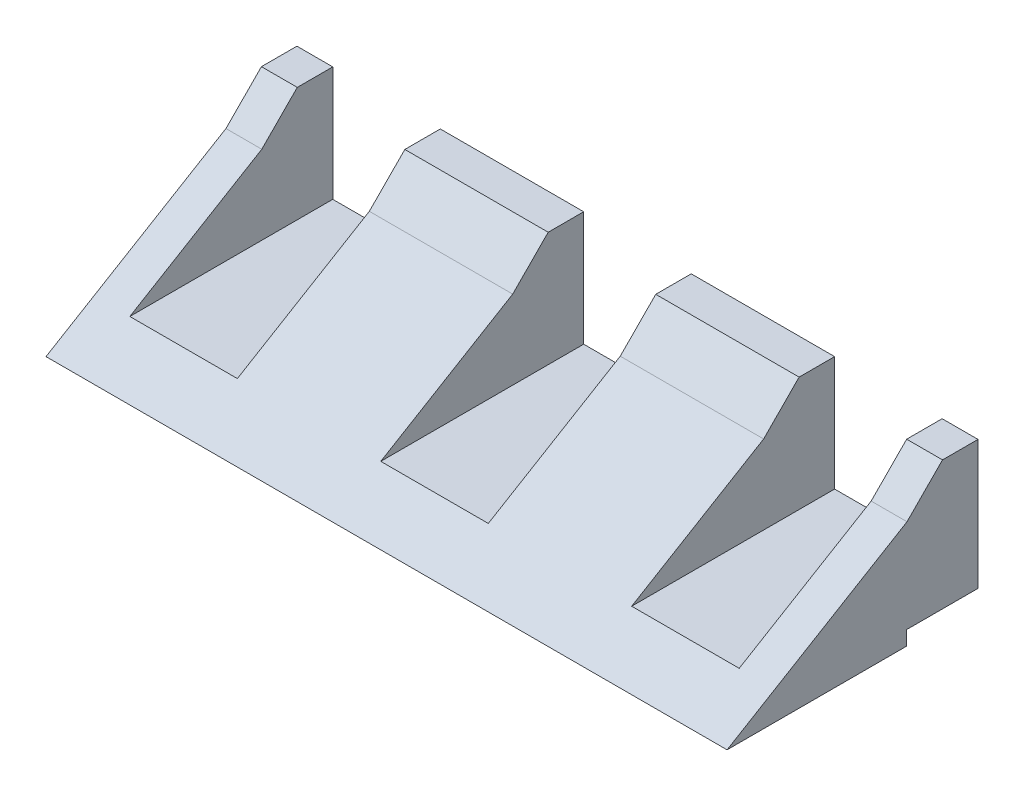
ISO-10303-21;
HEADER;
FILE_DESCRIPTION(('STEP AP214'),'2;1');
FILE_NAME('part.step','',(''),(''),'','','');
FILE_SCHEMA(('AUTOMOTIVE_DESIGN { 1 0 10303 214 1 1 1 1 }'));
ENDSEC;
DATA;
#1=APPLICATION_CONTEXT('core data for automotive mechanical design processes');
#2=APPLICATION_PROTOCOL_DEFINITION('international standard','automotive_design',2000,#1);
#3=PRODUCT_CONTEXT('',#1,'mechanical');
#4=PRODUCT('Part','Part','',(#3));
#5=PRODUCT_RELATED_PRODUCT_CATEGORY('part','',(#4));
#6=PRODUCT_DEFINITION_FORMATION('','',#4);
#7=PRODUCT_DEFINITION_CONTEXT('part definition',#1,'design');
#8=PRODUCT_DEFINITION('design','',#6,#7);
#9=PRODUCT_DEFINITION_SHAPE('','',#8);
#10=(LENGTH_UNIT() NAMED_UNIT(*) SI_UNIT(.MILLI.,.METRE.));
#11=(NAMED_UNIT(*) PLANE_ANGLE_UNIT() SI_UNIT($,.RADIAN.));
#12=(NAMED_UNIT(*) SI_UNIT($,.STERADIAN.) SOLID_ANGLE_UNIT());
#13=UNCERTAINTY_MEASURE_WITH_UNIT(LENGTH_MEASURE(1.E-05),#10,'distance_accuracy_value','');
#14=(GEOMETRIC_REPRESENTATION_CONTEXT(3) GLOBAL_UNCERTAINTY_ASSIGNED_CONTEXT((#13)) GLOBAL_UNIT_ASSIGNED_CONTEXT((#10,
#11,#12)) REPRESENTATION_CONTEXT('',''));
#15=CARTESIAN_POINT('',(0.,0.,0.));
#16=DIRECTION('',(0.,0.,1.));
#17=DIRECTION('',(1.,0.,0.));
#18=AXIS2_PLACEMENT_3D('',#15,#16,#17);
#19=CARTESIAN_POINT('',(0.,0.,0.));
#20=DIRECTION('',(0.,1.,0.));
#21=DIRECTION('',(0.,0.,1.));
#22=AXIS2_PLACEMENT_3D('',#19,#20,#21);
#23=PLANE('',#22);
#24=DIRECTION('',(1.,0.,0.));
#25=VECTOR('',#24,1.);
#26=CARTESIAN_POINT('',(-80.795321637427,0.,-0.877192982456136));
#27=LINE('',#26,#25);
#28=CARTESIAN_POINT('',(-54.7953216374269,0.,-0.877192982456139));
#29=VERTEX_POINT('',#28);
#30=CARTESIAN_POINT('',(40.2046783625731,0.,-0.877192982456146));
#31=VERTEX_POINT('',#30);
#32=EDGE_CURVE('E257',#29,#31,#27,.T.);
#33=ORIENTED_EDGE('',*,*,#32,.T.);
#34=DIRECTION('',(0.,0.,-1.));
#35=VECTOR('',#34,1.);
#36=CARTESIAN_POINT('',(40.2046783625731,0.,24.1228070175439));
#37=LINE('',#36,#35);
#38=CARTESIAN_POINT('',(40.2046783625731,0.,24.1228070175439));
#39=VERTEX_POINT('',#38);
#40=EDGE_CURVE('E215',#39,#31,#37,.T.);
#41=ORIENTED_EDGE('',*,*,#40,.F.);
#42=DIRECTION('',(1.,0.,0.));
#43=VECTOR('',#42,1.);
#44=CARTESIAN_POINT('',(40.2046783625731,0.,24.1228070175439));
#45=LINE('',#44,#43);
#46=CARTESIAN_POINT('',(-54.7953216374269,0.,24.1228070175439));
#47=VERTEX_POINT('',#46);
#48=EDGE_CURVE('E221',#47,#39,#45,.T.);
#49=ORIENTED_EDGE('',*,*,#48,.F.);
#50=DIRECTION('',(0.,0.,1.));
#51=VECTOR('',#50,1.);
#52=CARTESIAN_POINT('',(-54.7953216374269,0.,24.1228070175439));
#53=LINE('',#52,#51);
#54=EDGE_CURVE('E209',#29,#47,#53,.T.);
#55=ORIENTED_EDGE('',*,*,#54,.F.);
#56=EDGE_LOOP('',(#33,#41,#49,#55));
#57=FACE_BOUND('',#56,.T.);
#58=ADVANCED_FACE('F32',(#57),#23,.F.);
#59=CARTESIAN_POINT('',(0.,20.,0.));
#60=DIRECTION('',(0.,1.,0.));
#61=DIRECTION('',(0.,0.,1.));
#62=AXIS2_PLACEMENT_3D('',#59,#60,#61);
#63=PLANE('',#62);
#64=DIRECTION('',(-1.,0.,0.));
#65=VECTOR('',#64,1.);
#66=CARTESIAN_POINT('',(41.2046783625731,20.,-5.92683447989541));
#67=LINE('',#66,#65);
#68=CARTESIAN_POINT('',(-49.7953216374269,20.,-5.92683447989541));
#69=VERTEX_POINT('',#68);
#70=CARTESIAN_POINT('',(-54.7953216374269,20.,-5.92683447989541));
#71=VERTEX_POINT('',#70);
#72=EDGE_CURVE('E179',#69,#71,#67,.T.);
#73=ORIENTED_EDGE('',*,*,#72,.F.);
#74=DIRECTION('',(0.,0.,-1.));
#75=VECTOR('',#74,1.);
#76=CARTESIAN_POINT('',(-49.7953216374269,20.,33.));
#77=LINE('',#76,#75);
#78=CARTESIAN_POINT('',(-49.7953216374269,20.,-10.8771929824562));
#79=VERTEX_POINT('',#78);
#80=EDGE_CURVE('E305',#69,#79,#77,.T.);
#81=ORIENTED_EDGE('',*,*,#80,.T.);
#82=DIRECTION('',(1.,0.,0.));
#83=VECTOR('',#82,1.);
#84=CARTESIAN_POINT('',(-54.7963216374269,20.,-10.8771929824561));
#85=LINE('',#84,#83);
#86=CARTESIAN_POINT('',(-54.7953216374269,20.,-10.8771929824561));
#87=VERTEX_POINT('',#86);
#88=EDGE_CURVE('E203',#87,#79,#85,.T.);
#89=ORIENTED_EDGE('',*,*,#88,.F.);
#90=DIRECTION('',(0.,0.,-1.));
#91=VECTOR('',#90,1.);
#92=CARTESIAN_POINT('',(-54.7953216374269,20.,-11.));
#93=LINE('',#92,#91);
#94=EDGE_CURVE('E194',#71,#87,#93,.T.);
#95=ORIENTED_EDGE('',*,*,#94,.F.);
#96=EDGE_LOOP('',(#73,#81,#89,#95));
#97=FACE_BOUND('',#96,.T.);
#98=ADVANCED_FACE('F201',(#97),#63,.T.);
#99=CARTESIAN_POINT('',(-14.7953216374269,20.,-5.92683447989541));
#100=VERTEX_POINT('',#99);
#101=CARTESIAN_POINT('',(-34.7953216374269,20.,-5.92683447989541));
#102=VERTEX_POINT('',#101);
#103=EDGE_CURVE('E189',#100,#102,#67,.T.);
#104=ORIENTED_EDGE('',*,*,#103,.F.);
#105=DIRECTION('',(0.,0.,-1.));
#106=VECTOR('',#105,1.);
#107=CARTESIAN_POINT('',(-14.7953216374269,20.,33.));
#108=LINE('',#107,#106);
#109=CARTESIAN_POINT('',(-14.7953216374269,20.,-10.8771929824562));
#110=VERTEX_POINT('',#109);
#111=EDGE_CURVE('E295',#100,#110,#108,.T.);
#112=ORIENTED_EDGE('',*,*,#111,.T.);
#113=CARTESIAN_POINT('',(-34.7953216374269,20.,-10.8771929824562));
#114=VERTEX_POINT('',#113);
#115=EDGE_CURVE('E406',#114,#110,#85,.T.);
#116=ORIENTED_EDGE('',*,*,#115,.F.);
#117=DIRECTION('',(0.,0.,-1.));
#118=VECTOR('',#117,1.);
#119=CARTESIAN_POINT('',(-34.7953216374269,20.,33.));
#120=LINE('',#119,#118);
#121=EDGE_CURVE('E292',#102,#114,#120,.T.);
#122=ORIENTED_EDGE('',*,*,#121,.F.);
#123=EDGE_LOOP('',(#104,#112,#116,#122));
#124=FACE_BOUND('',#123,.T.);
#125=ADVANCED_FACE('F405',(#124),#63,.T.);
#126=CARTESIAN_POINT('',(20.2046783625731,20.,-5.92683447989541));
#127=VERTEX_POINT('',#126);
#128=CARTESIAN_POINT('',(0.204678362573135,20.,-5.92683447989541));
#129=VERTEX_POINT('',#128);
#130=EDGE_CURVE('E54',#127,#129,#67,.T.);
#131=ORIENTED_EDGE('',*,*,#130,.F.);
#132=DIRECTION('',(0.,0.,-1.));
#133=VECTOR('',#132,1.);
#134=CARTESIAN_POINT('',(20.2046783625731,20.,33.));
#135=LINE('',#134,#133);
#136=CARTESIAN_POINT('',(20.2046783625731,20.,-10.8771929824562));
#137=VERTEX_POINT('',#136);
#138=EDGE_CURVE('E313',#127,#137,#135,.T.);
#139=ORIENTED_EDGE('',*,*,#138,.T.);
#140=CARTESIAN_POINT('',(0.204678362573135,20.,-10.8771929824562));
#141=VERTEX_POINT('',#140);
#142=EDGE_CURVE('E273',#141,#137,#85,.T.);
#143=ORIENTED_EDGE('',*,*,#142,.F.);
#144=DIRECTION('',(0.,0.,-1.));
#145=VECTOR('',#144,1.);
#146=CARTESIAN_POINT('',(0.204678362573135,20.,33.));
#147=LINE('',#146,#145);
#148=EDGE_CURVE('E297',#129,#141,#147,.T.);
#149=ORIENTED_EDGE('',*,*,#148,.F.);
#150=EDGE_LOOP('',(#131,#139,#143,#149));
#151=FACE_BOUND('',#150,.T.);
#152=ADVANCED_FACE('F412',(#151),#63,.T.);
#153=CARTESIAN_POINT('',(40.2046783625731,20.,-5.92683447989541));
#154=VERTEX_POINT('',#153);
#155=CARTESIAN_POINT('',(35.2046783625731,20.,-5.92683447989541));
#156=VERTEX_POINT('',#155);
#157=EDGE_CURVE('E47',#154,#156,#67,.T.);
#158=ORIENTED_EDGE('',*,*,#157,.F.);
#159=DIRECTION('',(0.,0.,-1.));
#160=VECTOR('',#159,1.);
#161=CARTESIAN_POINT('',(40.2046783625731,20.,24.1228070175439));
#162=LINE('',#161,#160);
#163=CARTESIAN_POINT('',(40.2046783625731,20.,-10.8771929824562));
#164=VERTEX_POINT('',#163);
#165=EDGE_CURVE('E218',#154,#164,#162,.T.);
#166=ORIENTED_EDGE('',*,*,#165,.T.);
#167=CARTESIAN_POINT('',(35.2046783625731,20.,-10.8771929824562));
#168=VERTEX_POINT('',#167);
#169=EDGE_CURVE('E271',#168,#164,#85,.T.);
#170=ORIENTED_EDGE('',*,*,#169,.F.);
#171=DIRECTION('',(0.,0.,-1.));
#172=VECTOR('',#171,1.);
#173=CARTESIAN_POINT('',(35.2046783625731,20.,33.));
#174=LINE('',#173,#172);
#175=EDGE_CURVE('E315',#156,#168,#174,.T.);
#176=ORIENTED_EDGE('',*,*,#175,.F.);
#177=EDGE_LOOP('',(#158,#166,#170,#176));
#178=FACE_BOUND('',#177,.T.);
#179=ADVANCED_FACE('F397',(#178),#63,.T.);
#180=CARTESIAN_POINT('',(-59.7963216374269,15.,-0.976475977334668));
#181=DIRECTION('',(0.,-0.858390415060727,-0.512996973998748));
#182=DIRECTION('',(0.,0.512996973998748,-0.858390415060728));
#183=AXIS2_PLACEMENT_3D('',#180,#181,#182);
#184=PLANE('',#183);
#185=DIRECTION('',(0.,-0.512996973998748,0.858390415060728));
#186=VECTOR('',#185,1.);
#187=CARTESIAN_POINT('',(-14.7953216374269,15.,-0.976475977334667));
#188=LINE('',#187,#186);
#189=CARTESIAN_POINT('',(-14.7953216374269,15.,-0.976475977334676));
#190=VERTEX_POINT('',#189);
#191=CARTESIAN_POINT('',(-14.7953216374269,3.99999999999999,17.4296648855763));
#192=VERTEX_POINT('',#191);
#193=EDGE_CURVE('E246',#190,#192,#188,.T.);
#194=ORIENTED_EDGE('',*,*,#193,.F.);
#195=DIRECTION('',(1.,0.,0.));
#196=VECTOR('',#195,1.);
#197=CARTESIAN_POINT('',(-59.7963216374269,15.,-0.976475977334668));
#198=LINE('',#197,#196);
#199=CARTESIAN_POINT('',(-34.7953216374269,15.,-0.976475977334668));
#200=VERTEX_POINT('',#199);
#201=EDGE_CURVE('E216',#200,#190,#198,.T.);
#202=ORIENTED_EDGE('',*,*,#201,.F.);
#203=DIRECTION('',(0.,0.512996973998748,-0.858390415060728));
#204=VECTOR('',#203,1.);
#205=CARTESIAN_POINT('',(-34.7953216374269,15.,-0.976475977334669));
#206=LINE('',#205,#204);
#207=CARTESIAN_POINT('',(-34.7953216374269,4.,17.4296648855763));
#208=VERTEX_POINT('',#207);
#209=EDGE_CURVE('E237',#208,#200,#206,.T.);
#210=ORIENTED_EDGE('',*,*,#209,.F.);
#211=DIRECTION('',(1.,0.,0.));
#212=VECTOR('',#211,1.);
#213=CARTESIAN_POINT('',(-59.7963216374269,3.99999999999999,17.4296648855763));
#214=LINE('',#213,#212);
#215=CARTESIAN_POINT('',(-49.7953216374269,3.99999999999999,17.4296648855763));
#216=VERTEX_POINT('',#215);
#217=EDGE_CURVE('E232',#216,#208,#214,.T.);
#218=ORIENTED_EDGE('',*,*,#217,.F.);
#219=DIRECTION('',(0.,-0.512996973998748,0.858390415060728));
#220=VECTOR('',#219,1.);
#221=CARTESIAN_POINT('',(-49.7953216374269,15.,-0.976475977334669));
#222=LINE('',#221,#220);
#223=CARTESIAN_POINT('',(-49.7953216374269,15.,-0.976475977334676));
#224=VERTEX_POINT('',#223);
#225=EDGE_CURVE('E234',#224,#216,#222,.T.);
#226=ORIENTED_EDGE('',*,*,#225,.F.);
#227=CARTESIAN_POINT('',(-54.7953216374269,15.,-0.976475977334668));
#228=VERTEX_POINT('',#227);
#229=EDGE_CURVE('E213',#228,#224,#198,.T.);
#230=ORIENTED_EDGE('',*,*,#229,.F.);
#231=DIRECTION('',(0.,0.512996973998748,-0.858390415060727));
#232=VECTOR('',#231,1.);
#233=CARTESIAN_POINT('',(-54.7953216374269,15.,-0.976475977334668));
#234=LINE('',#233,#232);
#235=EDGE_CURVE('E197',#47,#228,#234,.T.);
#236=ORIENTED_EDGE('',*,*,#235,.F.);
#237=ORIENTED_EDGE('',*,*,#48,.T.);
#238=DIRECTION('',(0.,0.512996973998748,-0.858390415060728));
#239=VECTOR('',#238,1.);
#240=CARTESIAN_POINT('',(40.2046783625731,15.,-0.976475977334676));
#241=LINE('',#240,#239);
#242=CARTESIAN_POINT('',(40.2046783625731,15.,-0.976475977334668));
#243=VERTEX_POINT('',#242);
#244=EDGE_CURVE('E204',#39,#243,#241,.T.);
#245=ORIENTED_EDGE('',*,*,#244,.T.);
#246=CARTESIAN_POINT('',(35.2046783625731,15.,-0.976475977334668));
#247=VERTEX_POINT('',#246);
#248=EDGE_CURVE('E207',#247,#243,#198,.T.);
#249=ORIENTED_EDGE('',*,*,#248,.F.);
#250=DIRECTION('',(0.,0.512996973998748,-0.858390415060728));
#251=VECTOR('',#250,1.);
#252=CARTESIAN_POINT('',(35.2046783625731,15.,-0.97647597733467));
#253=LINE('',#252,#251);
#254=CARTESIAN_POINT('',(35.2046783625731,4.,17.4296648855762));
#255=VERTEX_POINT('',#254);
#256=EDGE_CURVE('E229',#255,#247,#253,.T.);
#257=ORIENTED_EDGE('',*,*,#256,.F.);
#258=DIRECTION('',(1.,0.,0.));
#259=VECTOR('',#258,1.);
#260=CARTESIAN_POINT('',(-59.7963216374269,3.99999999999998,17.4296648855763));
#261=LINE('',#260,#259);
#262=CARTESIAN_POINT('',(20.2046783625731,4.,17.4296648855762));
#263=VERTEX_POINT('',#262);
#264=EDGE_CURVE('E220',#263,#255,#261,.T.);
#265=ORIENTED_EDGE('',*,*,#264,.F.);
#266=DIRECTION('',(0.,-0.512996973998748,0.858390415060728));
#267=VECTOR('',#266,1.);
#268=CARTESIAN_POINT('',(20.2046783625731,15.,-0.97647597733467));
#269=LINE('',#268,#267);
#270=CARTESIAN_POINT('',(20.2046783625731,15.,-0.976475977334668));
#271=VERTEX_POINT('',#270);
#272=EDGE_CURVE('E226',#271,#263,#269,.T.);
#273=ORIENTED_EDGE('',*,*,#272,.F.);
#274=CARTESIAN_POINT('',(0.204678362573138,15.,-0.976475977334668));
#275=VERTEX_POINT('',#274);
#276=EDGE_CURVE('E217',#275,#271,#198,.T.);
#277=ORIENTED_EDGE('',*,*,#276,.F.);
#278=DIRECTION('',(0.,0.512996973998748,-0.858390415060728));
#279=VECTOR('',#278,1.);
#280=CARTESIAN_POINT('',(0.204678362573138,15.,-0.976475977334673));
#281=LINE('',#280,#279);
#282=CARTESIAN_POINT('',(0.204678362573139,4.,17.4296648855763));
#283=VERTEX_POINT('',#282);
#284=EDGE_CURVE('E240',#283,#275,#281,.T.);
#285=ORIENTED_EDGE('',*,*,#284,.F.);
#286=DIRECTION('',(1.,0.,0.));
#287=VECTOR('',#286,1.);
#288=CARTESIAN_POINT('',(-59.7963216374269,3.99999999999999,17.4296648855763));
#289=LINE('',#288,#287);
#290=EDGE_CURVE('E243',#192,#283,#289,.T.);
#291=ORIENTED_EDGE('',*,*,#290,.F.);
#292=EDGE_LOOP('',(#194,#202,#210,#218,#226,#230,#236,#237,#245,#249,#257,#265,#273,#277,#285,#291));
#293=FACE_BOUND('',#292,.T.);
#294=ADVANCED_FACE('F320',(#293),#184,.F.);
#295=CARTESIAN_POINT('',(40.2046783625731,20.,24.1228070175439));
#296=DIRECTION('',(-1.,0.,0.));
#297=DIRECTION('',(0.,0.,1.));
#298=AXIS2_PLACEMENT_3D('',#295,#296,#297);
#299=PLANE('',#298);
#300=ORIENTED_EDGE('',*,*,#165,.F.);
#301=DIRECTION('',(0.,-0.710625633720002,0.703570329604685));
#302=VECTOR('',#301,1.);
#303=CARTESIAN_POINT('',(40.2046783625731,4.97592714653301,8.94807487875505));
#304=LINE('',#303,#302);
#305=EDGE_CURVE('E329',#154,#243,#304,.T.);
#306=ORIENTED_EDGE('',*,*,#305,.T.);
#307=ORIENTED_EDGE('',*,*,#244,.F.);
#308=ORIENTED_EDGE('',*,*,#40,.T.);
#309=DIRECTION('',(0.,1.,0.));
#310=VECTOR('',#309,1.);
#311=CARTESIAN_POINT('',(40.2046783625731,0.,-0.877192982456146));
#312=LINE('',#311,#310);
#313=CARTESIAN_POINT('',(40.2046783625731,2.,-0.877192982456139));
#314=VERTEX_POINT('',#313);
#315=EDGE_CURVE('E327',#31,#314,#312,.T.);
#316=ORIENTED_EDGE('',*,*,#315,.T.);
#317=DIRECTION('',(0.,0.,1.));
#318=VECTOR('',#317,1.);
#319=CARTESIAN_POINT('',(40.2046783625731,2.,0.));
#320=LINE('',#319,#318);
#321=CARTESIAN_POINT('',(40.2046783625731,2.,-10.8771929824562));
#322=VERTEX_POINT('',#321);
#323=EDGE_CURVE('E392',#322,#314,#320,.T.);
#324=ORIENTED_EDGE('',*,*,#323,.F.);
#325=DIRECTION('',(0.,-1.,0.));
#326=VECTOR('',#325,1.);
#327=CARTESIAN_POINT('',(40.2046783625731,0.,-10.8771929824562));
#328=LINE('',#327,#326);
#329=EDGE_CURVE('E270',#164,#322,#328,.T.);
#330=ORIENTED_EDGE('',*,*,#329,.F.);
#331=EDGE_LOOP('',(#300,#306,#307,#308,#316,#324,#330));
#332=FACE_BOUND('',#331,.T.);
#333=ADVANCED_FACE('F34',(#332),#299,.F.);
#334=CARTESIAN_POINT('',(-54.7953216374269,0.,0.));
#335=DIRECTION('',(1.,0.,0.));
#336=DIRECTION('',(0.,0.,-1.));
#337=AXIS2_PLACEMENT_3D('',#334,#335,#336);
#338=PLANE('',#337);
#339=ORIENTED_EDGE('',*,*,#235,.T.);
#340=DIRECTION('',(0.,-0.710625633720002,0.703570329604685));
#341=VECTOR('',#340,1.);
#342=CARTESIAN_POINT('',(-54.7953216374269,15.,-0.976475977334668));
#343=LINE('',#342,#341);
#344=EDGE_CURVE('E182',#71,#228,#343,.T.);
#345=ORIENTED_EDGE('',*,*,#344,.F.);
#346=ORIENTED_EDGE('',*,*,#94,.T.);
#347=DIRECTION('',(0.,1.,0.));
#348=VECTOR('',#347,1.);
#349=CARTESIAN_POINT('',(-54.7953216374269,0.,-10.8771929824561));
#350=LINE('',#349,#348);
#351=CARTESIAN_POINT('',(-54.7953216374269,2.,-10.8771929824561));
#352=VERTEX_POINT('',#351);
#353=EDGE_CURVE('E259',#352,#87,#350,.T.);
#354=ORIENTED_EDGE('',*,*,#353,.F.);
#355=DIRECTION('',(0.,0.,1.));
#356=VECTOR('',#355,1.);
#357=CARTESIAN_POINT('',(-54.7953216374269,2.,0.));
#358=LINE('',#357,#356);
#359=CARTESIAN_POINT('',(-54.7953216374269,2.,-0.87719298245613));
#360=VERTEX_POINT('',#359);
#361=EDGE_CURVE('E248',#352,#360,#358,.T.);
#362=ORIENTED_EDGE('',*,*,#361,.T.);
#363=DIRECTION('',(0.,1.,0.));
#364=VECTOR('',#363,1.);
#365=CARTESIAN_POINT('',(-54.7953216374269,0.,-0.877192982456139));
#366=LINE('',#365,#364);
#367=EDGE_CURVE('E40',#29,#360,#366,.T.);
#368=ORIENTED_EDGE('',*,*,#367,.F.);
#369=ORIENTED_EDGE('',*,*,#54,.T.);
#370=EDGE_LOOP('',(#339,#345,#346,#354,#362,#368,#369));
#371=FACE_BOUND('',#370,.T.);
#372=ADVANCED_FACE('F192',(#371),#338,.F.);
#373=CARTESIAN_POINT('',(35.2046783625731,4.,33.));
#374=DIRECTION('',(-1.,0.,0.));
#375=DIRECTION('',(0.,0.,1.));
#376=AXIS2_PLACEMENT_3D('',#373,#374,#375);
#377=PLANE('',#376);
#378=DIRECTION('',(0.,-0.710625633720002,0.703570329604685));
#379=VECTOR('',#378,1.);
#380=CARTESIAN_POINT('',(35.2046783625731,-7.54226906407349,21.341986688335));
#381=LINE('',#380,#379);
#382=EDGE_CURVE('E385',#156,#247,#381,.T.);
#383=ORIENTED_EDGE('',*,*,#382,.F.);
#384=ORIENTED_EDGE('',*,*,#175,.T.);
#385=DIRECTION('',(0.,-1.,0.));
#386=VECTOR('',#385,1.);
#387=CARTESIAN_POINT('',(35.2046783625731,0.,-10.8771929824562));
#388=LINE('',#387,#386);
#389=CARTESIAN_POINT('',(35.2046783625731,4.,-10.8771929824562));
#390=VERTEX_POINT('',#389);
#391=EDGE_CURVE('E275',#168,#390,#388,.T.);
#392=ORIENTED_EDGE('',*,*,#391,.T.);
#393=DIRECTION('',(0.,0.,-1.));
#394=VECTOR('',#393,1.);
#395=CARTESIAN_POINT('',(35.2046783625731,4.,33.));
#396=LINE('',#395,#394);
#397=EDGE_CURVE('E299',#255,#390,#396,.T.);
#398=ORIENTED_EDGE('',*,*,#397,.F.);
#399=ORIENTED_EDGE('',*,*,#256,.T.);
#400=EDGE_LOOP('',(#383,#384,#392,#398,#399));
#401=FACE_BOUND('',#400,.T.);
#402=ADVANCED_FACE('F374',(#401),#377,.T.);
#403=CARTESIAN_POINT('',(20.2046783625731,20.,33.));
#404=DIRECTION('',(1.,0.,0.));
#405=DIRECTION('',(0.,0.,-1.));
#406=AXIS2_PLACEMENT_3D('',#403,#404,#405);
#407=PLANE('',#406);
#408=DIRECTION('',(0.,0.710625633720002,-0.703570329604685));
#409=VECTOR('',#408,1.);
#410=CARTESIAN_POINT('',(20.2046783625731,0.537551596725781,13.3423849068642));
#411=LINE('',#410,#409);
#412=EDGE_CURVE('E384',#271,#127,#411,.T.);
#413=ORIENTED_EDGE('',*,*,#412,.F.);
#414=ORIENTED_EDGE('',*,*,#272,.T.);
#415=DIRECTION('',(0.,0.,-1.));
#416=VECTOR('',#415,1.);
#417=CARTESIAN_POINT('',(20.2046783625731,4.,33.));
#418=LINE('',#417,#416);
#419=CARTESIAN_POINT('',(20.2046783625731,4.,-10.8771929824562));
#420=VERTEX_POINT('',#419);
#421=EDGE_CURVE('E310',#263,#420,#418,.T.);
#422=ORIENTED_EDGE('',*,*,#421,.T.);
#423=DIRECTION('',(0.,1.,0.));
#424=VECTOR('',#423,1.);
#425=CARTESIAN_POINT('',(20.2046783625731,0.,-10.8771929824562));
#426=LINE('',#425,#424);
#427=EDGE_CURVE('E367',#420,#137,#426,.T.);
#428=ORIENTED_EDGE('',*,*,#427,.T.);
#429=ORIENTED_EDGE('',*,*,#138,.F.);
#430=EDGE_LOOP('',(#413,#414,#422,#428,#429));
#431=FACE_BOUND('',#430,.T.);
#432=ADVANCED_FACE('F382',(#431),#407,.T.);
#433=CARTESIAN_POINT('',(20.2046783625731,4.,33.));
#434=DIRECTION('',(0.,1.,0.));
#435=DIRECTION('',(-1.,0.,0.));
#436=AXIS2_PLACEMENT_3D('',#433,#434,#435);
#437=PLANE('',#436);
#438=DIRECTION('',(-1.,0.,0.));
#439=VECTOR('',#438,1.);
#440=CARTESIAN_POINT('',(-54.7963216374269,3.99999999999998,-10.8771929824561));
#441=LINE('',#440,#439);
#442=EDGE_CURVE('E284',#390,#420,#441,.T.);
#443=ORIENTED_EDGE('',*,*,#442,.T.);
#444=ORIENTED_EDGE('',*,*,#421,.F.);
#445=ORIENTED_EDGE('',*,*,#264,.T.);
#446=ORIENTED_EDGE('',*,*,#397,.T.);
#447=EDGE_LOOP('',(#443,#444,#445,#446));
#448=FACE_BOUND('',#447,.T.);
#449=ADVANCED_FACE('F378',(#448),#437,.T.);
#450=CARTESIAN_POINT('',(-34.7953216374269,4.,33.));
#451=DIRECTION('',(-1.,0.,0.));
#452=DIRECTION('',(0.,0.,1.));
#453=AXIS2_PLACEMENT_3D('',#450,#451,#452);
#454=PLANE('',#453);
#455=DIRECTION('',(0.,-0.710625633720002,0.703570329604685));
#456=VECTOR('',#455,1.);
#457=CARTESIAN_POINT('',(-34.7953216374269,-7.5422690640735,21.341986688335));
#458=LINE('',#457,#456);
#459=EDGE_CURVE('E340',#102,#200,#458,.T.);
#460=ORIENTED_EDGE('',*,*,#459,.F.);
#461=ORIENTED_EDGE('',*,*,#121,.T.);
#462=DIRECTION('',(0.,-1.,0.));
#463=VECTOR('',#462,1.);
#464=CARTESIAN_POINT('',(-34.7953216374269,0.,-10.8771929824562));
#465=LINE('',#464,#463);
#466=CARTESIAN_POINT('',(-34.7953216374269,4.,-10.8771929824562));
#467=VERTEX_POINT('',#466);
#468=EDGE_CURVE('E359',#114,#467,#465,.T.);
#469=ORIENTED_EDGE('',*,*,#468,.T.);
#470=DIRECTION('',(0.,0.,-1.));
#471=VECTOR('',#470,1.);
#472=CARTESIAN_POINT('',(-34.7953216374269,4.,33.));
#473=LINE('',#472,#471);
#474=EDGE_CURVE('E287',#208,#467,#473,.T.);
#475=ORIENTED_EDGE('',*,*,#474,.F.);
#476=ORIENTED_EDGE('',*,*,#209,.T.);
#477=EDGE_LOOP('',(#460,#461,#469,#475,#476));
#478=FACE_BOUND('',#477,.T.);
#479=ADVANCED_FACE('F401',(#478),#454,.T.);
#480=CARTESIAN_POINT('',(-49.7953216374269,20.,33.));
#481=DIRECTION('',(1.,0.,0.));
#482=DIRECTION('',(0.,0.,-1.));
#483=AXIS2_PLACEMENT_3D('',#480,#481,#482);
#484=PLANE('',#483);
#485=DIRECTION('',(0.,0.710625633720002,-0.703570329604685));
#486=VECTOR('',#485,1.);
#487=CARTESIAN_POINT('',(-49.7953216374269,0.537551596725781,13.3423849068642));
#488=LINE('',#487,#486);
#489=EDGE_CURVE('E185',#224,#69,#488,.T.);
#490=ORIENTED_EDGE('',*,*,#489,.F.);
#491=ORIENTED_EDGE('',*,*,#225,.T.);
#492=DIRECTION('',(0.,0.,-1.));
#493=VECTOR('',#492,1.);
#494=CARTESIAN_POINT('',(-49.7953216374269,3.99999999999999,33.));
#495=LINE('',#494,#493);
#496=CARTESIAN_POINT('',(-49.7953216374269,3.99999999999999,-10.8771929824562));
#497=VERTEX_POINT('',#496);
#498=EDGE_CURVE('E302',#216,#497,#495,.T.);
#499=ORIENTED_EDGE('',*,*,#498,.T.);
#500=DIRECTION('',(0.,1.,0.));
#501=VECTOR('',#500,1.);
#502=CARTESIAN_POINT('',(-49.7953216374269,0.,-10.8771929824561));
#503=LINE('',#502,#501);
#504=EDGE_CURVE('E355',#497,#79,#503,.T.);
#505=ORIENTED_EDGE('',*,*,#504,.T.);
#506=ORIENTED_EDGE('',*,*,#80,.F.);
#507=EDGE_LOOP('',(#490,#491,#499,#505,#506));
#508=FACE_BOUND('',#507,.T.);
#509=ADVANCED_FACE('F447',(#508),#484,.T.);
#510=CARTESIAN_POINT('',(-49.7953216374269,3.99999999999999,33.));
#511=DIRECTION('',(0.,1.,0.));
#512=DIRECTION('',(-1.,0.,0.));
#513=AXIS2_PLACEMENT_3D('',#510,#511,#512);
#514=PLANE('',#513);
#515=DIRECTION('',(-1.,0.,0.));
#516=VECTOR('',#515,1.);
#517=CARTESIAN_POINT('',(-54.7963216374269,3.99999999999999,-10.8771929824561));
#518=LINE('',#517,#516);
#519=EDGE_CURVE('E281',#467,#497,#518,.T.);
#520=ORIENTED_EDGE('',*,*,#519,.T.);
#521=ORIENTED_EDGE('',*,*,#498,.F.);
#522=ORIENTED_EDGE('',*,*,#217,.T.);
#523=ORIENTED_EDGE('',*,*,#474,.T.);
#524=EDGE_LOOP('',(#520,#521,#522,#523));
#525=FACE_BOUND('',#524,.T.);
#526=ADVANCED_FACE('F450',(#525),#514,.T.);
#527=CARTESIAN_POINT('',(-14.7953216374269,20.,33.));
#528=DIRECTION('',(1.,0.,0.));
#529=DIRECTION('',(0.,1.,0.));
#530=AXIS2_PLACEMENT_3D('',#527,#528,#529);
#531=PLANE('',#530);
#532=DIRECTION('',(0.,0.710625633720002,-0.703570329604685));
#533=VECTOR('',#532,1.);
#534=CARTESIAN_POINT('',(-14.7953216374269,0.537551596725781,13.3423849068642));
#535=LINE('',#534,#533);
#536=EDGE_CURVE('E337',#190,#100,#535,.T.);
#537=ORIENTED_EDGE('',*,*,#536,.F.);
#538=ORIENTED_EDGE('',*,*,#193,.T.);
#539=DIRECTION('',(0.,0.,-1.));
#540=VECTOR('',#539,1.);
#541=CARTESIAN_POINT('',(-14.7953216374269,3.99999999999999,33.));
#542=LINE('',#541,#540);
#543=CARTESIAN_POINT('',(-14.7953216374269,3.99999999999999,-10.8771929824562));
#544=VERTEX_POINT('',#543);
#545=EDGE_CURVE('E291',#192,#544,#542,.T.);
#546=ORIENTED_EDGE('',*,*,#545,.T.);
#547=DIRECTION('',(0.,1.,0.));
#548=VECTOR('',#547,1.);
#549=CARTESIAN_POINT('',(-14.7953216374269,0.,-10.8771929824562));
#550=LINE('',#549,#548);
#551=EDGE_CURVE('E353',#544,#110,#550,.T.);
#552=ORIENTED_EDGE('',*,*,#551,.T.);
#553=ORIENTED_EDGE('',*,*,#111,.F.);
#554=EDGE_LOOP('',(#537,#538,#546,#552,#553));
#555=FACE_BOUND('',#554,.T.);
#556=ADVANCED_FACE('F344',(#555),#531,.T.);
#557=CARTESIAN_POINT('',(-14.7953216374269,3.99999999999999,33.));
#558=DIRECTION('',(0.,1.,0.));
#559=DIRECTION('',(-1.,0.,0.));
#560=AXIS2_PLACEMENT_3D('',#557,#558,#559);
#561=PLANE('',#560);
#562=DIRECTION('',(-1.,0.,0.));
#563=VECTOR('',#562,1.);
#564=CARTESIAN_POINT('',(-54.7963216374269,3.99999999999999,-10.8771929824561));
#565=LINE('',#564,#563);
#566=CARTESIAN_POINT('',(0.204678362573136,4.,-10.8771929824562));
#567=VERTEX_POINT('',#566);
#568=EDGE_CURVE('E278',#567,#544,#565,.T.);
#569=ORIENTED_EDGE('',*,*,#568,.T.);
#570=ORIENTED_EDGE('',*,*,#545,.F.);
#571=ORIENTED_EDGE('',*,*,#290,.T.);
#572=DIRECTION('',(0.,0.,-1.));
#573=VECTOR('',#572,1.);
#574=CARTESIAN_POINT('',(0.204678362573136,4.,33.));
#575=LINE('',#574,#573);
#576=EDGE_CURVE('E288',#283,#567,#575,.T.);
#577=ORIENTED_EDGE('',*,*,#576,.T.);
#578=EDGE_LOOP('',(#569,#570,#571,#577));
#579=FACE_BOUND('',#578,.T.);
#580=ADVANCED_FACE('F352',(#579),#561,.T.);
#581=CARTESIAN_POINT('',(0.204678362573136,4.,33.));
#582=DIRECTION('',(-1.,0.,0.));
#583=DIRECTION('',(0.,-1.,0.));
#584=AXIS2_PLACEMENT_3D('',#581,#582,#583);
#585=PLANE('',#584);
#586=DIRECTION('',(0.,-0.710625633720002,0.703570329604685));
#587=VECTOR('',#586,1.);
#588=CARTESIAN_POINT('',(0.204678362573138,-7.5422690640735,21.341986688335));
#589=LINE('',#588,#587);
#590=EDGE_CURVE('E11',#129,#275,#589,.T.);
#591=ORIENTED_EDGE('',*,*,#590,.F.);
#592=ORIENTED_EDGE('',*,*,#148,.T.);
#593=DIRECTION('',(0.,-1.,0.));
#594=VECTOR('',#593,1.);
#595=CARTESIAN_POINT('',(0.204678362573138,0.,-10.8771929824562));
#596=LINE('',#595,#594);
#597=EDGE_CURVE('E356',#141,#567,#596,.T.);
#598=ORIENTED_EDGE('',*,*,#597,.T.);
#599=ORIENTED_EDGE('',*,*,#576,.F.);
#600=ORIENTED_EDGE('',*,*,#284,.T.);
#601=EDGE_LOOP('',(#591,#592,#598,#599,#600));
#602=FACE_BOUND('',#601,.T.);
#603=ADVANCED_FACE('F414',(#602),#585,.T.);
#604=CARTESIAN_POINT('',(-54.7963216374269,0.,-10.8771929824561));
#605=DIRECTION('',(0.,0.,1.));
#606=DIRECTION('',(1.,0.,0.));
#607=AXIS2_PLACEMENT_3D('',#604,#605,#606);
#608=PLANE('',#607);
#609=ORIENTED_EDGE('',*,*,#353,.T.);
#610=ORIENTED_EDGE('',*,*,#88,.T.);
#611=ORIENTED_EDGE('',*,*,#504,.F.);
#612=ORIENTED_EDGE('',*,*,#519,.F.);
#613=ORIENTED_EDGE('',*,*,#468,.F.);
#614=ORIENTED_EDGE('',*,*,#115,.T.);
#615=ORIENTED_EDGE('',*,*,#551,.F.);
#616=ORIENTED_EDGE('',*,*,#568,.F.);
#617=ORIENTED_EDGE('',*,*,#597,.F.);
#618=ORIENTED_EDGE('',*,*,#142,.T.);
#619=ORIENTED_EDGE('',*,*,#427,.F.);
#620=ORIENTED_EDGE('',*,*,#442,.F.);
#621=ORIENTED_EDGE('',*,*,#391,.F.);
#622=ORIENTED_EDGE('',*,*,#169,.T.);
#623=ORIENTED_EDGE('',*,*,#329,.T.);
#624=DIRECTION('',(1.,0.,0.));
#625=VECTOR('',#624,1.);
#626=CARTESIAN_POINT('',(-54.7963216374269,2.,-10.8771929824561));
#627=LINE('',#626,#625);
#628=EDGE_CURVE('E264',#352,#322,#627,.T.);
#629=ORIENTED_EDGE('',*,*,#628,.F.);
#630=EDGE_LOOP('',(#609,#610,#611,#612,#613,#614,#615,#616,#617,#618,#619,#620,#621,#622,#623,#629));
#631=FACE_BOUND('',#630,.T.);
#632=ADVANCED_FACE('F267',(#631),#608,.F.);
#633=CARTESIAN_POINT('',(-80.795321637427,0.,-0.877192982456136));
#634=DIRECTION('',(0.,0.,-1.));
#635=DIRECTION('',(0.,1.,0.));
#636=AXIS2_PLACEMENT_3D('',#633,#634,#635);
#637=PLANE('',#636);
#638=ORIENTED_EDGE('',*,*,#367,.T.);
#639=DIRECTION('',(1.,0.,0.));
#640=VECTOR('',#639,1.);
#641=CARTESIAN_POINT('',(-80.795321637427,2.,-0.87719298245613));
#642=LINE('',#641,#640);
#643=EDGE_CURVE('E254',#360,#314,#642,.T.);
#644=ORIENTED_EDGE('',*,*,#643,.T.);
#645=ORIENTED_EDGE('',*,*,#315,.F.);
#646=ORIENTED_EDGE('',*,*,#32,.F.);
#647=EDGE_LOOP('',(#638,#644,#645,#646));
#648=FACE_BOUND('',#647,.T.);
#649=ADVANCED_FACE('F253',(#648),#637,.T.);
#650=CARTESIAN_POINT('',(-80.795321637427,2.,0.));
#651=DIRECTION('',(0.,1.,0.));
#652=DIRECTION('',(0.,0.,1.));
#653=AXIS2_PLACEMENT_3D('',#650,#651,#652);
#654=PLANE('',#653);
#655=ORIENTED_EDGE('',*,*,#361,.F.);
#656=ORIENTED_EDGE('',*,*,#628,.T.);
#657=ORIENTED_EDGE('',*,*,#323,.T.);
#658=ORIENTED_EDGE('',*,*,#643,.F.);
#659=EDGE_LOOP('',(#655,#656,#657,#658));
#660=FACE_BOUND('',#659,.T.);
#661=ADVANCED_FACE('F263',(#660),#654,.F.);
#662=CARTESIAN_POINT('',(41.2046783625731,15.,-0.976475977334668));
#663=DIRECTION('',(0.,-0.703570329604685,-0.710625633720002));
#664=DIRECTION('',(0.,0.710625633720002,-0.703570329604685));
#665=AXIS2_PLACEMENT_3D('',#662,#663,#664);
#666=PLANE('',#665);
#667=ORIENTED_EDGE('',*,*,#412,.T.);
#668=ORIENTED_EDGE('',*,*,#130,.T.);
#669=ORIENTED_EDGE('',*,*,#590,.T.);
#670=ORIENTED_EDGE('',*,*,#276,.T.);
#671=EDGE_LOOP('',(#667,#668,#669,#670));
#672=FACE_BOUND('',#671,.T.);
#673=ADVANCED_FACE('F415',(#672),#666,.F.);
#674=ORIENTED_EDGE('',*,*,#459,.T.);
#675=ORIENTED_EDGE('',*,*,#201,.T.);
#676=ORIENTED_EDGE('',*,*,#536,.T.);
#677=ORIENTED_EDGE('',*,*,#103,.T.);
#678=EDGE_LOOP('',(#674,#675,#676,#677));
#679=FACE_BOUND('',#678,.T.);
#680=ADVANCED_FACE('F336',(#679),#666,.F.);
#681=ORIENTED_EDGE('',*,*,#489,.T.);
#682=ORIENTED_EDGE('',*,*,#72,.T.);
#683=ORIENTED_EDGE('',*,*,#344,.T.);
#684=ORIENTED_EDGE('',*,*,#229,.T.);
#685=EDGE_LOOP('',(#681,#682,#683,#684));
#686=FACE_BOUND('',#685,.T.);
#687=ADVANCED_FACE('F181',(#686),#666,.F.);
#688=ORIENTED_EDGE('',*,*,#157,.T.);
#689=ORIENTED_EDGE('',*,*,#382,.T.);
#690=ORIENTED_EDGE('',*,*,#248,.T.);
#691=ORIENTED_EDGE('',*,*,#305,.F.);
#692=EDGE_LOOP('',(#688,#689,#690,#691));
#693=FACE_BOUND('',#692,.T.);
#694=ADVANCED_FACE('F418',(#693),#666,.F.);
#695=CLOSED_SHELL('',(#58,#98,#125,#152,#179,#294,#333,#372,#402,#432,#449,#479,#509,#526,#556,
#580,#603,#632,#649,#661,#673,#680,#687,#694));
#696=MANIFOLD_SOLID_BREP('B2',#695);
#697=ADVANCED_BREP_SHAPE_REPRESENTATION('',(#18,#696),#14);
#698=SHAPE_DEFINITION_REPRESENTATION(#9,#697);
ENDSEC;
END-ISO-10303-21;
